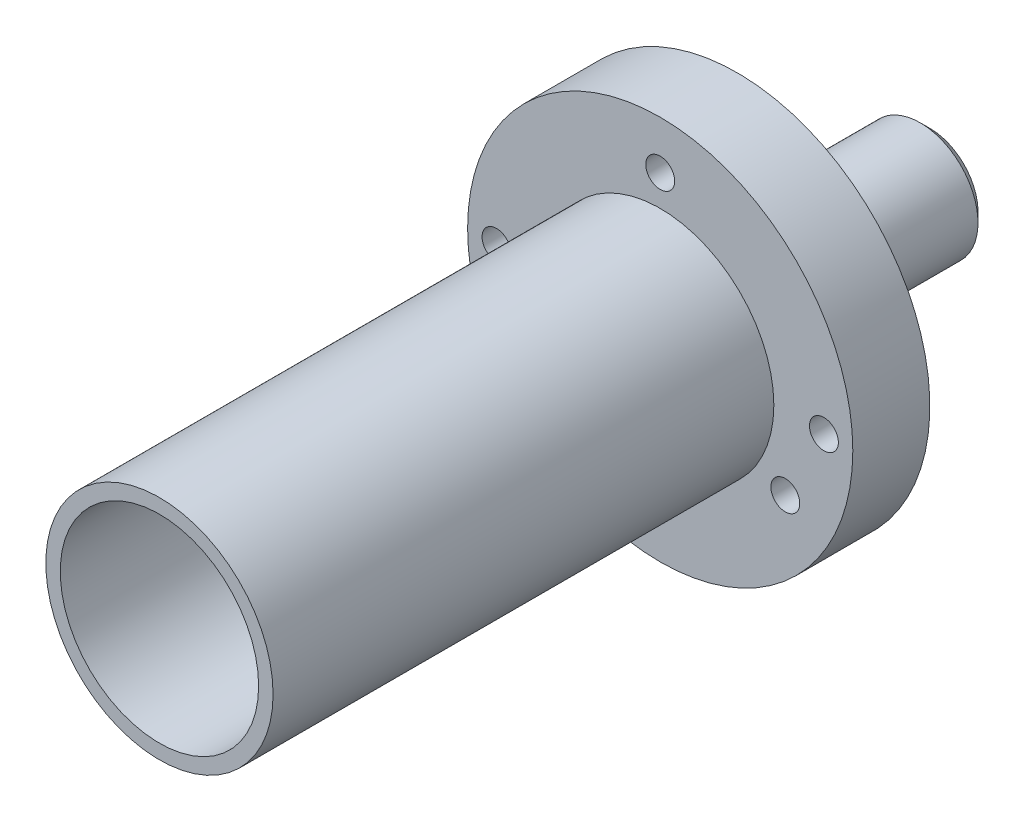
ISO-10303-21;
HEADER;
FILE_DESCRIPTION(('STEP AP214'),'2;1');
FILE_NAME('part.step','',(''),(''),'','','');
FILE_SCHEMA(('AUTOMOTIVE_DESIGN { 1 0 10303 214 1 1 1 1 }'));
ENDSEC;
DATA;
#1=APPLICATION_CONTEXT('core data for automotive mechanical design processes');
#2=APPLICATION_PROTOCOL_DEFINITION('international standard','automotive_design',2000,#1);
#3=PRODUCT_CONTEXT('',#1,'mechanical');
#4=PRODUCT('Part','Part','',(#3));
#5=PRODUCT_RELATED_PRODUCT_CATEGORY('part','',(#4));
#6=PRODUCT_DEFINITION_FORMATION('','',#4);
#7=PRODUCT_DEFINITION_CONTEXT('part definition',#1,'design');
#8=PRODUCT_DEFINITION('design','',#6,#7);
#9=PRODUCT_DEFINITION_SHAPE('','',#8);
#10=(LENGTH_UNIT() NAMED_UNIT(*) SI_UNIT(.MILLI.,.METRE.));
#11=(NAMED_UNIT(*) PLANE_ANGLE_UNIT() SI_UNIT($,.RADIAN.));
#12=(NAMED_UNIT(*) SI_UNIT($,.STERADIAN.) SOLID_ANGLE_UNIT());
#13=UNCERTAINTY_MEASURE_WITH_UNIT(LENGTH_MEASURE(1.E-05),#10,'distance_accuracy_value','');
#14=(GEOMETRIC_REPRESENTATION_CONTEXT(3) GLOBAL_UNCERTAINTY_ASSIGNED_CONTEXT((#13)) GLOBAL_UNIT_ASSIGNED_CONTEXT((#10,
#11,#12)) REPRESENTATION_CONTEXT('',''));
#15=CARTESIAN_POINT('',(0.,0.,0.));
#16=DIRECTION('',(0.,0.,1.));
#17=DIRECTION('',(1.,0.,0.));
#18=AXIS2_PLACEMENT_3D('',#15,#16,#17);
#19=CARTESIAN_POINT('',(0.,0.,2.));
#20=DIRECTION('',(0.,0.,1.));
#21=DIRECTION('',(1.,0.,0.));
#22=AXIS2_PLACEMENT_3D('',#19,#20,#21);
#23=PLANE('',#22);
#24=CARTESIAN_POINT('',(0.,7.5,2.));
#25=DIRECTION('',(0.,0.,1.));
#26=DIRECTION('',(1.,0.,0.));
#27=AXIS2_PLACEMENT_3D('',#24,#25,#26);
#28=CIRCLE('',#27,0.749999999999999);
#29=CARTESIAN_POINT('',(0.749999999999999,7.5,2.));
#30=VERTEX_POINT('',#29);
#31=EDGE_CURVE('E97',#30,#30,#28,.F.);
#32=ORIENTED_EDGE('',*,*,#31,.T.);
#33=EDGE_LOOP('',(#32));
#34=FACE_BOUND('',#33,.T.);
#35=CARTESIAN_POINT('',(-6.49519052838421,-3.75000000000005,2.));
#36=DIRECTION('',(0.,0.,1.));
#37=DIRECTION('',(1.,0.,0.));
#38=AXIS2_PLACEMENT_3D('',#35,#36,#37);
#39=CIRCLE('',#38,0.750000000000001);
#40=CARTESIAN_POINT('',(-5.74519052838421,-3.75000000000005,2.));
#41=VERTEX_POINT('',#40);
#42=EDGE_CURVE('E91',#41,#41,#39,.F.);
#43=ORIENTED_EDGE('',*,*,#42,.T.);
#44=EDGE_LOOP('',(#43));
#45=FACE_BOUND('',#44,.T.);
#46=CARTESIAN_POINT('',(6.49519052838287,-3.75000000000083,2.));
#47=DIRECTION('',(0.,0.,1.));
#48=DIRECTION('',(1.,0.,0.));
#49=AXIS2_PLACEMENT_3D('',#46,#47,#48);
#50=CIRCLE('',#49,0.749999999999998);
#51=CARTESIAN_POINT('',(7.24519052838287,-3.75000000000083,2.));
#52=VERTEX_POINT('',#51);
#53=EDGE_CURVE('E85',#52,#52,#50,.F.);
#54=ORIENTED_EDGE('',*,*,#53,.T.);
#55=EDGE_LOOP('',(#54));
#56=FACE_BOUND('',#55,.T.);
#57=CARTESIAN_POINT('',(0.,0.,2.));
#58=DIRECTION('',(0.,0.,1.));
#59=DIRECTION('',(1.,0.,0.));
#60=AXIS2_PLACEMENT_3D('',#57,#58,#59);
#61=CIRCLE('',#60,10.);
#62=CARTESIAN_POINT('',(10.,0.,2.));
#63=VERTEX_POINT('',#62);
#64=EDGE_CURVE('E54',#63,#63,#61,.T.);
#65=ORIENTED_EDGE('',*,*,#64,.T.);
#66=EDGE_LOOP('',(#65));
#67=FACE_BOUND('',#66,.T.);
#68=CARTESIAN_POINT('',(-8.5,0.,2.));
#69=DIRECTION('',(0.,0.,1.));
#70=DIRECTION('',(1.,0.,0.));
#71=AXIS2_PLACEMENT_3D('',#68,#69,#70);
#72=CIRCLE('',#71,0.75);
#73=CARTESIAN_POINT('',(-7.75,0.,2.));
#74=VERTEX_POINT('',#73);
#75=EDGE_CURVE('E64',#74,#74,#72,.F.);
#76=ORIENTED_EDGE('',*,*,#75,.T.);
#77=EDGE_LOOP('',(#76));
#78=FACE_BOUND('',#77,.T.);
#79=CARTESIAN_POINT('',(8.5,0.,2.));
#80=DIRECTION('',(0.,0.,1.));
#81=DIRECTION('',(1.,0.,0.));
#82=AXIS2_PLACEMENT_3D('',#79,#80,#81);
#83=CIRCLE('',#82,0.75);
#84=CARTESIAN_POINT('',(9.25,0.,2.));
#85=VERTEX_POINT('',#84);
#86=EDGE_CURVE('E71',#85,#85,#83,.F.);
#87=ORIENTED_EDGE('',*,*,#86,.T.);
#88=EDGE_LOOP('',(#87));
#89=FACE_BOUND('',#88,.T.);
#90=CARTESIAN_POINT('',(0.,0.,2.));
#91=DIRECTION('',(0.,0.,1.));
#92=DIRECTION('',(1.,0.,0.));
#93=AXIS2_PLACEMENT_3D('',#90,#91,#92);
#94=CIRCLE('',#93,5.9);
#95=CARTESIAN_POINT('',(5.9,0.,2.));
#96=VERTEX_POINT('',#95);
#97=EDGE_CURVE('E76',#96,#96,#94,.T.);
#98=ORIENTED_EDGE('',*,*,#97,.F.);
#99=EDGE_LOOP('',(#98));
#100=FACE_BOUND('',#99,.T.);
#101=ADVANCED_FACE('F33',(#34,#45,#56,#67,#78,#89,#100),#23,.T.);
#102=CARTESIAN_POINT('',(0.,0.,2.));
#103=DIRECTION('',(0.,0.,-1.));
#104=DIRECTION('',(-1.,0.,0.));
#105=AXIS2_PLACEMENT_3D('',#102,#103,#104);
#106=CYLINDRICAL_SURFACE('',#105,10.);
#107=ORIENTED_EDGE('',*,*,#64,.F.);
#108=EDGE_LOOP('',(#107));
#109=FACE_BOUND('',#108,.T.);
#110=CARTESIAN_POINT('',(0.,0.,-2.));
#111=DIRECTION('',(0.,0.,-1.));
#112=DIRECTION('',(-1.,0.,0.));
#113=AXIS2_PLACEMENT_3D('',#110,#111,#112);
#114=CIRCLE('',#113,10.);
#115=CARTESIAN_POINT('',(-10.,0.,-2.));
#116=VERTEX_POINT('',#115);
#117=EDGE_CURVE('E60',#116,#116,#114,.T.);
#118=ORIENTED_EDGE('',*,*,#117,.F.);
#119=EDGE_LOOP('',(#118));
#120=FACE_BOUND('',#119,.T.);
#121=ADVANCED_FACE('F109',(#109,#120),#106,.T.);
#122=CARTESIAN_POINT('',(0.,0.,-2.));
#123=DIRECTION('',(0.,0.,-1.));
#124=DIRECTION('',(-1.,0.,0.));
#125=AXIS2_PLACEMENT_3D('',#122,#123,#124);
#126=PLANE('',#125);
#127=CARTESIAN_POINT('',(0.,7.5,-2.));
#128=DIRECTION('',(0.,0.,-1.));
#129=DIRECTION('',(-1.,0.,0.));
#130=AXIS2_PLACEMENT_3D('',#127,#128,#129);
#131=CIRCLE('',#130,0.749999999999999);
#132=CARTESIAN_POINT('',(-0.749999999999999,7.5,-2.));
#133=VERTEX_POINT('',#132);
#134=EDGE_CURVE('E84',#133,#133,#131,.T.);
#135=ORIENTED_EDGE('',*,*,#134,.F.);
#136=EDGE_LOOP('',(#135));
#137=FACE_BOUND('',#136,.T.);
#138=CARTESIAN_POINT('',(-6.49519052838421,-3.75000000000005,-2.));
#139=DIRECTION('',(0.,0.,-1.));
#140=DIRECTION('',(-1.,0.,0.));
#141=AXIS2_PLACEMENT_3D('',#138,#139,#140);
#142=CIRCLE('',#141,0.750000000000001);
#143=CARTESIAN_POINT('',(-7.24519052838422,-3.75000000000005,-2.));
#144=VERTEX_POINT('',#143);
#145=EDGE_CURVE('E94',#144,#144,#142,.T.);
#146=ORIENTED_EDGE('',*,*,#145,.F.);
#147=EDGE_LOOP('',(#146));
#148=FACE_BOUND('',#147,.T.);
#149=CARTESIAN_POINT('',(6.49519052838287,-3.75000000000083,-2.));
#150=DIRECTION('',(0.,0.,-1.));
#151=DIRECTION('',(-1.,0.,0.));
#152=AXIS2_PLACEMENT_3D('',#149,#150,#151);
#153=CIRCLE('',#152,0.749999999999998);
#154=CARTESIAN_POINT('',(5.74519052838287,-3.75000000000083,-2.));
#155=VERTEX_POINT('',#154);
#156=EDGE_CURVE('E88',#155,#155,#153,.T.);
#157=ORIENTED_EDGE('',*,*,#156,.F.);
#158=EDGE_LOOP('',(#157));
#159=FACE_BOUND('',#158,.T.);
#160=CARTESIAN_POINT('',(8.5,0.,-2.));
#161=DIRECTION('',(0.,0.,-1.));
#162=DIRECTION('',(-1.,0.,0.));
#163=AXIS2_PLACEMENT_3D('',#160,#161,#162);
#164=CIRCLE('',#163,0.75);
#165=CARTESIAN_POINT('',(7.75,0.,-2.));
#166=VERTEX_POINT('',#165);
#167=EDGE_CURVE('E63',#166,#166,#164,.T.);
#168=ORIENTED_EDGE('',*,*,#167,.F.);
#169=EDGE_LOOP('',(#168));
#170=FACE_BOUND('',#169,.T.);
#171=CARTESIAN_POINT('',(-8.5,0.,-2.));
#172=DIRECTION('',(0.,0.,-1.));
#173=DIRECTION('',(-1.,0.,0.));
#174=AXIS2_PLACEMENT_3D('',#171,#172,#173);
#175=CIRCLE('',#174,0.75);
#176=CARTESIAN_POINT('',(-9.25,0.,-2.));
#177=VERTEX_POINT('',#176);
#178=EDGE_CURVE('E67',#177,#177,#175,.T.);
#179=ORIENTED_EDGE('',*,*,#178,.F.);
#180=EDGE_LOOP('',(#179));
#181=FACE_BOUND('',#180,.T.);
#182=CARTESIAN_POINT('',(0.,0.,-2.));
#183=DIRECTION('',(0.,0.,-1.));
#184=DIRECTION('',(-1.,0.,0.));
#185=AXIS2_PLACEMENT_3D('',#182,#183,#184);
#186=CIRCLE('',#185,3.99999999999999);
#187=CARTESIAN_POINT('',(-3.99999999999999,0.,-2.));
#188=VERTEX_POINT('',#187);
#189=EDGE_CURVE('E45',#188,#188,#186,.F.);
#190=ORIENTED_EDGE('',*,*,#189,.T.);
#191=EDGE_LOOP('',(#190));
#192=FACE_BOUND('',#191,.T.);
#193=ORIENTED_EDGE('',*,*,#117,.T.);
#194=EDGE_LOOP('',(#193));
#195=FACE_BOUND('',#194,.T.);
#196=ADVANCED_FACE('F105',(#137,#148,#159,#170,#181,#192,#195),#126,.T.);
#197=CARTESIAN_POINT('',(0.,0.,-12.));
#198=DIRECTION('',(0.,0.,1.));
#199=DIRECTION('',(1.,0.,0.));
#200=AXIS2_PLACEMENT_3D('',#197,#198,#199);
#201=CYLINDRICAL_SURFACE('',#200,3.);
#202=CARTESIAN_POINT('',(0.,0.,-11.5));
#203=DIRECTION('',(0.,0.,-1.));
#204=DIRECTION('',(-1.,0.,0.));
#205=AXIS2_PLACEMENT_3D('',#202,#203,#204);
#206=CIRCLE('',#205,3.);
#207=CARTESIAN_POINT('',(-3.,0.,-11.5));
#208=VERTEX_POINT('',#207);
#209=EDGE_CURVE('E10',#208,#208,#206,.F.);
#210=ORIENTED_EDGE('',*,*,#209,.T.);
#211=EDGE_LOOP('',(#210));
#212=FACE_BOUND('',#211,.T.);
#213=CARTESIAN_POINT('',(0.,0.,-3.00000000000001));
#214=DIRECTION('',(0.,0.,-1.));
#215=DIRECTION('',(-1.,0.,0.));
#216=AXIS2_PLACEMENT_3D('',#213,#214,#215);
#217=CIRCLE('',#216,3.);
#218=CARTESIAN_POINT('',(-3.,0.,-3.00000000000001));
#219=VERTEX_POINT('',#218);
#220=EDGE_CURVE('E49',#219,#219,#217,.T.);
#221=ORIENTED_EDGE('',*,*,#220,.T.);
#222=EDGE_LOOP('',(#221));
#223=FACE_BOUND('',#222,.T.);
#224=ADVANCED_FACE('F108',(#212,#223),#201,.T.);
#225=CARTESIAN_POINT('',(0.,0.,-12.));
#226=DIRECTION('',(0.,0.,-1.));
#227=DIRECTION('',(-1.,0.,0.));
#228=AXIS2_PLACEMENT_3D('',#225,#226,#227);
#229=PLANE('',#228);
#230=CARTESIAN_POINT('',(0.,0.,-12.));
#231=DIRECTION('',(0.,0.,-1.));
#232=DIRECTION('',(-1.,0.,0.));
#233=AXIS2_PLACEMENT_3D('',#230,#231,#232);
#234=CIRCLE('',#233,2.5);
#235=CARTESIAN_POINT('',(-2.5,0.,-12.));
#236=VERTEX_POINT('',#235);
#237=EDGE_CURVE('E41',#236,#236,#234,.T.);
#238=ORIENTED_EDGE('',*,*,#237,.T.);
#239=EDGE_LOOP('',(#238));
#240=FACE_BOUND('',#239,.T.);
#241=ADVANCED_FACE('F140',(#240),#229,.T.);
#242=CARTESIAN_POINT('',(0.,0.,-3.00000000000001));
#243=DIRECTION('',(0.,0.,1.));
#244=DIRECTION('',(1.,0.,0.));
#245=AXIS2_PLACEMENT_3D('',#242,#243,#244);
#246=CONICAL_SURFACE('',#245,3.,0.785398163397441);
#247=ORIENTED_EDGE('',*,*,#189,.F.);
#248=EDGE_LOOP('',(#247));
#249=FACE_BOUND('',#248,.T.);
#250=ORIENTED_EDGE('',*,*,#220,.F.);
#251=EDGE_LOOP('',(#250));
#252=FACE_BOUND('',#251,.T.);
#253=ADVANCED_FACE('F136',(#249,#252),#246,.T.);
#254=CARTESIAN_POINT('',(0.,0.,-12.));
#255=DIRECTION('',(0.,0.,1.));
#256=DIRECTION('',(1.,0.,0.));
#257=AXIS2_PLACEMENT_3D('',#254,#255,#256);
#258=CONICAL_SURFACE('',#257,2.5,0.785398163397448);
#259=ORIENTED_EDGE('',*,*,#209,.F.);
#260=EDGE_LOOP('',(#259));
#261=FACE_BOUND('',#260,.T.);
#262=ORIENTED_EDGE('',*,*,#237,.F.);
#263=EDGE_LOOP('',(#262));
#264=FACE_BOUND('',#263,.T.);
#265=ADVANCED_FACE('F36',(#261,#264),#258,.T.);
#266=CARTESIAN_POINT('',(-8.5,0.,2.001));
#267=DIRECTION('',(0.,0.,-1.));
#268=DIRECTION('',(-1.,0.,0.));
#269=AXIS2_PLACEMENT_3D('',#266,#267,#268);
#270=CYLINDRICAL_SURFACE('',#269,0.75);
#271=ORIENTED_EDGE('',*,*,#75,.F.);
#272=EDGE_LOOP('',(#271));
#273=FACE_BOUND('',#272,.T.);
#274=ORIENTED_EDGE('',*,*,#178,.T.);
#275=EDGE_LOOP('',(#274));
#276=FACE_BOUND('',#275,.T.);
#277=ADVANCED_FACE('F146',(#273,#276),#270,.F.);
#278=CARTESIAN_POINT('',(8.5,0.,2.001));
#279=DIRECTION('',(0.,0.,-1.));
#280=DIRECTION('',(-1.,0.,0.));
#281=AXIS2_PLACEMENT_3D('',#278,#279,#280);
#282=CYLINDRICAL_SURFACE('',#281,0.75);
#283=ORIENTED_EDGE('',*,*,#86,.F.);
#284=EDGE_LOOP('',(#283));
#285=FACE_BOUND('',#284,.T.);
#286=ORIENTED_EDGE('',*,*,#167,.T.);
#287=EDGE_LOOP('',(#286));
#288=FACE_BOUND('',#287,.T.);
#289=ADVANCED_FACE('F178',(#285,#288),#282,.F.);
#290=CARTESIAN_POINT('',(0.,0.,28.));
#291=DIRECTION('',(0.,0.,1.));
#292=DIRECTION('',(1.,0.,0.));
#293=AXIS2_PLACEMENT_3D('',#290,#291,#292);
#294=PLANE('',#293);
#295=CARTESIAN_POINT('',(0.,0.,28.));
#296=DIRECTION('',(0.,0.,1.));
#297=DIRECTION('',(1.,0.,0.));
#298=AXIS2_PLACEMENT_3D('',#295,#296,#297);
#299=CIRCLE('',#298,5.9);
#300=CARTESIAN_POINT('',(5.9,0.,28.));
#301=VERTEX_POINT('',#300);
#302=EDGE_CURVE('E68',#301,#301,#299,.T.);
#303=ORIENTED_EDGE('',*,*,#302,.T.);
#304=EDGE_LOOP('',(#303));
#305=FACE_BOUND('',#304,.T.);
#306=CARTESIAN_POINT('',(0.,0.,28.));
#307=DIRECTION('',(0.,0.,1.));
#308=DIRECTION('',(1.,0.,0.));
#309=AXIS2_PLACEMENT_3D('',#306,#307,#308);
#310=CIRCLE('',#309,5.15);
#311=CARTESIAN_POINT('',(5.15,0.,28.));
#312=VERTEX_POINT('',#311);
#313=EDGE_CURVE('E79',#312,#312,#310,.T.);
#314=ORIENTED_EDGE('',*,*,#313,.F.);
#315=EDGE_LOOP('',(#314));
#316=FACE_BOUND('',#315,.T.);
#317=ADVANCED_FACE('F176',(#305,#316),#294,.T.);
#318=CARTESIAN_POINT('',(0.,0.,28.));
#319=DIRECTION('',(0.,0.,-1.));
#320=DIRECTION('',(-1.,0.,0.));
#321=AXIS2_PLACEMENT_3D('',#318,#319,#320);
#322=CYLINDRICAL_SURFACE('',#321,5.9);
#323=ORIENTED_EDGE('',*,*,#302,.F.);
#324=EDGE_LOOP('',(#323));
#325=FACE_BOUND('',#324,.T.);
#326=ORIENTED_EDGE('',*,*,#97,.T.);
#327=EDGE_LOOP('',(#326));
#328=FACE_BOUND('',#327,.T.);
#329=ADVANCED_FACE('F161',(#325,#328),#322,.T.);
#330=CARTESIAN_POINT('',(0.,0.,0.));
#331=DIRECTION('',(0.,0.,-1.));
#332=DIRECTION('',(-1.,0.,0.));
#333=AXIS2_PLACEMENT_3D('',#330,#331,#332);
#334=PLANE('',#333);
#335=CARTESIAN_POINT('',(0.,0.,0.));
#336=DIRECTION('',(0.,0.,1.));
#337=DIRECTION('',(1.,0.,0.));
#338=AXIS2_PLACEMENT_3D('',#335,#336,#337);
#339=CIRCLE('',#338,5.15);
#340=CARTESIAN_POINT('',(5.15,0.,0.));
#341=VERTEX_POINT('',#340);
#342=EDGE_CURVE('E57',#341,#341,#339,.T.);
#343=ORIENTED_EDGE('',*,*,#342,.T.);
#344=EDGE_LOOP('',(#343));
#345=FACE_BOUND('',#344,.T.);
#346=ADVANCED_FACE('F158',(#345),#334,.F.);
#347=CARTESIAN_POINT('',(0.,0.,2.));
#348=DIRECTION('',(0.,0.,-1.));
#349=DIRECTION('',(-1.,0.,0.));
#350=AXIS2_PLACEMENT_3D('',#347,#348,#349);
#351=CYLINDRICAL_SURFACE('',#350,5.15);
#352=ORIENTED_EDGE('',*,*,#342,.F.);
#353=EDGE_LOOP('',(#352));
#354=FACE_BOUND('',#353,.T.);
#355=ORIENTED_EDGE('',*,*,#313,.T.);
#356=EDGE_LOOP('',(#355));
#357=FACE_BOUND('',#356,.T.);
#358=ADVANCED_FACE('F160',(#354,#357),#351,.F.);
#359=CARTESIAN_POINT('',(6.49519052838287,-3.75000000000083,28.001));
#360=DIRECTION('',(0.,0.,-1.));
#361=DIRECTION('',(-1.,0.,0.));
#362=AXIS2_PLACEMENT_3D('',#359,#360,#361);
#363=CYLINDRICAL_SURFACE('',#362,0.749999999999998);
#364=ORIENTED_EDGE('',*,*,#53,.F.);
#365=EDGE_LOOP('',(#364));
#366=FACE_BOUND('',#365,.T.);
#367=ORIENTED_EDGE('',*,*,#156,.T.);
#368=EDGE_LOOP('',(#367));
#369=FACE_BOUND('',#368,.T.);
#370=ADVANCED_FACE('F164',(#366,#369),#363,.F.);
#371=CARTESIAN_POINT('',(-6.49519052838421,-3.75000000000005,28.001));
#372=DIRECTION('',(0.,0.,-1.));
#373=DIRECTION('',(-1.,0.,0.));
#374=AXIS2_PLACEMENT_3D('',#371,#372,#373);
#375=CYLINDRICAL_SURFACE('',#374,0.750000000000001);
#376=ORIENTED_EDGE('',*,*,#42,.F.);
#377=EDGE_LOOP('',(#376));
#378=FACE_BOUND('',#377,.T.);
#379=ORIENTED_EDGE('',*,*,#145,.T.);
#380=EDGE_LOOP('',(#379));
#381=FACE_BOUND('',#380,.T.);
#382=ADVANCED_FACE('F169',(#378,#381),#375,.F.);
#383=CARTESIAN_POINT('',(0.,7.5,28.001));
#384=DIRECTION('',(0.,0.,-1.));
#385=DIRECTION('',(-1.,0.,0.));
#386=AXIS2_PLACEMENT_3D('',#383,#384,#385);
#387=CYLINDRICAL_SURFACE('',#386,0.749999999999999);
#388=ORIENTED_EDGE('',*,*,#31,.F.);
#389=EDGE_LOOP('',(#388));
#390=FACE_BOUND('',#389,.T.);
#391=ORIENTED_EDGE('',*,*,#134,.T.);
#392=EDGE_LOOP('',(#391));
#393=FACE_BOUND('',#392,.T.);
#394=ADVANCED_FACE('F103',(#390,#393),#387,.F.);
#395=CLOSED_SHELL('',(#101,#121,#196,#224,#241,#253,#265,#277,#289,#317,#329,#346,#358,#370,
#382,#394));
#396=MANIFOLD_SOLID_BREP('B2',#395);
#397=ADVANCED_BREP_SHAPE_REPRESENTATION('',(#18,#396),#14);
#398=SHAPE_DEFINITION_REPRESENTATION(#9,#397);
ENDSEC;
END-ISO-10303-21;
